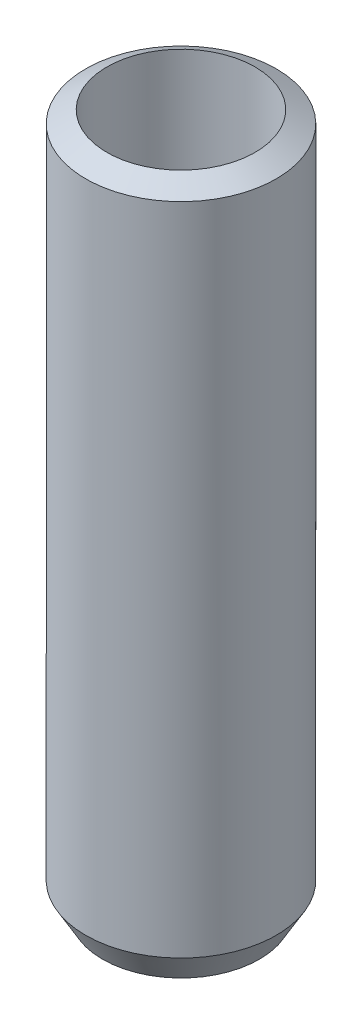
ISO-10303-21;
HEADER;
FILE_DESCRIPTION(('STEP AP214'),'2;1');
FILE_NAME('part.step','',(''),(''),'','','');
FILE_SCHEMA(('AUTOMOTIVE_DESIGN { 1 0 10303 214 1 1 1 1 }'));
ENDSEC;
DATA;
#1=APPLICATION_CONTEXT('core data for automotive mechanical design processes');
#2=APPLICATION_PROTOCOL_DEFINITION('international standard','automotive_design',2000,#1);
#3=PRODUCT_CONTEXT('',#1,'mechanical');
#4=PRODUCT('Part','Part','',(#3));
#5=PRODUCT_RELATED_PRODUCT_CATEGORY('part','',(#4));
#6=PRODUCT_DEFINITION_FORMATION('','',#4);
#7=PRODUCT_DEFINITION_CONTEXT('part definition',#1,'design');
#8=PRODUCT_DEFINITION('design','',#6,#7);
#9=PRODUCT_DEFINITION_SHAPE('','',#8);
#10=(LENGTH_UNIT() NAMED_UNIT(*) SI_UNIT(.MILLI.,.METRE.));
#11=(NAMED_UNIT(*) PLANE_ANGLE_UNIT() SI_UNIT($,.RADIAN.));
#12=(NAMED_UNIT(*) SI_UNIT($,.STERADIAN.) SOLID_ANGLE_UNIT());
#13=UNCERTAINTY_MEASURE_WITH_UNIT(LENGTH_MEASURE(1.E-05),#10,'distance_accuracy_value','');
#14=(GEOMETRIC_REPRESENTATION_CONTEXT(3) GLOBAL_UNCERTAINTY_ASSIGNED_CONTEXT((#13)) GLOBAL_UNIT_ASSIGNED_CONTEXT((#10,
#11,#12)) REPRESENTATION_CONTEXT('',''));
#15=CARTESIAN_POINT('',(0.,0.,0.));
#16=DIRECTION('',(0.,0.,1.));
#17=DIRECTION('',(1.,0.,0.));
#18=AXIS2_PLACEMENT_3D('',#15,#16,#17);
#19=CARTESIAN_POINT('',(0.,202.297191738934,0.));
#20=DIRECTION('',(0.,-1.,0.));
#21=DIRECTION('',(0.,0.,-1.));
#22=AXIS2_PLACEMENT_3D('',#19,#20,#21);
#23=CYLINDRICAL_SURFACE('',#22,27.5);
#24=CARTESIAN_POINT('',(0.,197.431912768181,0.));
#25=DIRECTION('',(0.,1.,0.));
#26=DIRECTION('',(0.,0.,1.));
#27=AXIS2_PLACEMENT_3D('',#24,#25,#26);
#28=CIRCLE('',#27,27.5);
#29=CARTESIAN_POINT('',(0.,197.431912768181,-27.5));
#30=VERTEX_POINT('',#29);
#31=EDGE_CURVE('E50',#30,#30,#28,.F.);
#32=CARTESIAN_POINT('',(0.,8.42691037034057,0.));
#33=DIRECTION('',(0.,1.,0.));
#34=DIRECTION('',(0.,0.,1.));
#35=AXIS2_PLACEMENT_3D('',#32,#33,#34);
#36=CIRCLE('',#35,27.5);
#37=CARTESIAN_POINT('',(0.,8.42691037034057,-27.5));
#38=VERTEX_POINT('',#37);
#39=EDGE_CURVE('E51',#38,#38,#36,.T.);
#40=CARTESIAN_POINT('',(0.,197.431912768181,-27.5));
#41=CARTESIAN_POINT('',(0.,195.46311065987,-27.5));
#42=CARTESIAN_POINT('',(0.,193.494308551559,-27.5));
#43=CARTESIAN_POINT('',(0.,189.556704334937,-27.5));
#44=CARTESIAN_POINT('',(0.,187.587902226627,-27.5));
#45=CARTESIAN_POINT('',(0.,183.650298010005,-27.5));
#46=CARTESIAN_POINT('',(0.,181.681495901694,-27.5));
#47=CARTESIAN_POINT('',(0.,177.743891685072,-27.5));
#48=CARTESIAN_POINT('',(0.,175.775089576762,-27.5));
#49=CARTESIAN_POINT('',(0.,171.83748536014,-27.5));
#50=CARTESIAN_POINT('',(0.,169.868683251829,-27.5));
#51=CARTESIAN_POINT('',(0.,165.931079035207,-27.5));
#52=CARTESIAN_POINT('',(0.,163.962276926897,-27.5));
#53=CARTESIAN_POINT('',(0.,160.024672710275,-27.5));
#54=CARTESIAN_POINT('',(0.,158.055870601964,-27.5));
#55=CARTESIAN_POINT('',(0.,154.118266385342,-27.5));
#56=CARTESIAN_POINT('',(0.,152.149464277032,-27.5));
#57=CARTESIAN_POINT('',(0.,148.21186006041,-27.5));
#58=CARTESIAN_POINT('',(0.,146.243057952099,-27.5));
#59=CARTESIAN_POINT('',(0.,142.305453735477,-27.5));
#60=CARTESIAN_POINT('',(0.,140.336651627167,-27.5));
#61=CARTESIAN_POINT('',(0.,136.399047410545,-27.5));
#62=CARTESIAN_POINT('',(0.,134.430245302234,-27.5));
#63=CARTESIAN_POINT('',(0.,130.492641085612,-27.5));
#64=CARTESIAN_POINT('',(0.,128.523838977302,-27.5));
#65=CARTESIAN_POINT('',(0.,124.58623476068,-27.5));
#66=CARTESIAN_POINT('',(0.,122.617432652369,-27.5));
#67=CARTESIAN_POINT('',(0.,118.679828435747,-27.5));
#68=CARTESIAN_POINT('',(0.,116.711026327437,-27.5));
#69=CARTESIAN_POINT('',(0.,112.773422110815,-27.5));
#70=CARTESIAN_POINT('',(0.,110.804620002504,-27.5));
#71=CARTESIAN_POINT('',(0.,106.867015785882,-27.5));
#72=CARTESIAN_POINT('',(0.,104.898213677572,-27.5));
#73=CARTESIAN_POINT('',(0.,100.96060946095,-27.5));
#74=CARTESIAN_POINT('',(0.,98.991807352639,-27.5));
#75=CARTESIAN_POINT('',(0.,95.0542031360173,-27.5));
#76=CARTESIAN_POINT('',(0.,93.0854010277065,-27.5));
#77=CARTESIAN_POINT('',(0.,89.1477968110848,-27.5));
#78=CARTESIAN_POINT('',(0.,87.178994702774,-27.5));
#79=CARTESIAN_POINT('',(0.,83.2413904861523,-27.5));
#80=CARTESIAN_POINT('',(0.,81.2725883778415,-27.5));
#81=CARTESIAN_POINT('',(0.,77.3349841612198,-27.5));
#82=CARTESIAN_POINT('',(0.,75.366182052909,-27.5));
#83=CARTESIAN_POINT('',(0.,71.4285778362873,-27.5));
#84=CARTESIAN_POINT('',(0.,69.4597757279765,-27.5));
#85=CARTESIAN_POINT('',(0.,65.5221715113548,-27.5));
#86=CARTESIAN_POINT('',(0.,63.553369403044,-27.5));
#87=CARTESIAN_POINT('',(0.,59.6157651864223,-27.5));
#88=CARTESIAN_POINT('',(0.,57.6469630781115,-27.5));
#89=CARTESIAN_POINT('',(0.,53.7093588614898,-27.5));
#90=CARTESIAN_POINT('',(0.,51.740556753179,-27.5));
#91=CARTESIAN_POINT('',(0.,47.8029525365573,-27.5));
#92=CARTESIAN_POINT('',(0.,45.8341504282465,-27.5));
#93=CARTESIAN_POINT('',(0.,41.8965462116248,-27.5));
#94=CARTESIAN_POINT('',(0.,39.927744103314,-27.5));
#95=CARTESIAN_POINT('',(0.,35.9901398866923,-27.5));
#96=CARTESIAN_POINT('',(0.,34.0213377783815,-27.5));
#97=CARTESIAN_POINT('',(0.,30.0837335617598,-27.5));
#98=CARTESIAN_POINT('',(0.,28.114931453449,-27.5));
#99=CARTESIAN_POINT('',(0.,24.1773272368273,-27.5));
#100=CARTESIAN_POINT('',(0.,22.2085251285164,-27.5));
#101=CARTESIAN_POINT('',(0.,18.2709209118947,-27.5));
#102=CARTESIAN_POINT('',(0.,16.3021188035839,-27.5));
#103=CARTESIAN_POINT('',(0.,12.3645145869622,-27.5));
#104=CARTESIAN_POINT('',(0.,10.3957124786514,-27.5));
#105=CARTESIAN_POINT('',(0.,8.42691037034057,-27.5));
#106=B_SPLINE_CURVE_WITH_KNOTS('',3,(#40,#41,#42,#43,#44,#45,#46,#47,#48,#49,#50,#51,#52,#53,
#54,#55,#56,#57,#58,#59,#60,#61,#62,#63,#64,#65,#66,#67,#68,#69,#70,#71,#72,#73,#74,#75,#76,#77,
#78,#79,#80,#81,#82,#83,#84,#85,#86,#87,#88,#89,#90,#91,#92,#93,#94,#95,#96,#97,#98,#99,#100,
#101,#102,#103,#104,#105),.UNSPECIFIED.,.F.,.F.,(4,2,2,2,2,2,2,2,2,2,2,2,2,2,2,2,2,2,2,2,2,2,2,
2,2,2,2,2,2,2,2,2,4),(0.,5.90640632493253,11.812812649865,17.7192189747975,23.62562529973,
29.5320316246625,35.438437949595,41.3448442745275,47.2512505994601,53.1576569243926,
59.0640632493251,64.9704695742576,70.8768758991901,76.7832822241226,82.6896885490551,
88.5960948739876,94.5025011989201,100.408907523853,106.315313848785,112.221720173718,
118.12812649865,124.034532823583,129.940939148515,135.847345473448,141.75375179838,
147.660158123313,153.566564448245,159.472970773178,165.37937709811,171.285783423043,
177.192189747975,183.098596072908,189.00500239784),.UNSPECIFIED.);
#107=EDGE_CURVE('BSEAM39',#30,#38,#106,.T.);
#108=ORIENTED_EDGE('',*,*,#31,.T.);
#109=ORIENTED_EDGE('',*,*,#39,.T.);
#110=ORIENTED_EDGE('',*,*,#107,.T.);
#111=ORIENTED_EDGE('',*,*,#107,.F.);
#112=EDGE_LOOP('',(#108,#110,#109,#111));
#113=FACE_BOUND('',#112,.T.);
#114=ADVANCED_FACE('F39',(#113),#23,.T.);
#115=CARTESIAN_POINT('',(0.,0.,0.));
#116=DIRECTION('',(0.,1.,0.));
#117=DIRECTION('',(0.,0.,1.));
#118=AXIS2_PLACEMENT_3D('',#115,#116,#117);
#119=PLANE('',#118);
#120=CARTESIAN_POINT('',(0.,0.,0.));
#121=DIRECTION('',(0.,1.,0.));
#122=DIRECTION('',(0.,0.,1.));
#123=AXIS2_PLACEMENT_3D('',#120,#121,#122);
#124=CIRCLE('',#123,22.634721029247);
#125=CARTESIAN_POINT('',(0.,0.,22.634721029247));
#126=VERTEX_POINT('',#125);
#127=EDGE_CURVE('E10',#126,#126,#124,.F.);
#128=ORIENTED_EDGE('',*,*,#127,.T.);
#129=EDGE_LOOP('',(#128));
#130=FACE_BOUND('',#129,.T.);
#131=CARTESIAN_POINT('',(0.,0.,0.));
#132=DIRECTION('',(0.,1.,0.));
#133=DIRECTION('',(0.,0.,1.));
#134=AXIS2_PLACEMENT_3D('',#131,#132,#133);
#135=CIRCLE('',#134,21.3774367296382);
#136=CARTESIAN_POINT('',(0.,0.,-21.3774367296382));
#137=VERTEX_POINT('',#136);
#138=EDGE_CURVE('E58',#137,#137,#135,.T.);
#139=ORIENTED_EDGE('',*,*,#138,.T.);
#140=EDGE_LOOP('',(#139));
#141=FACE_BOUND('',#140,.T.);
#142=ADVANCED_FACE('F62',(#130,#141),#119,.F.);
#143=CARTESIAN_POINT('',(0.,202.297191738934,0.));
#144=DIRECTION('',(0.,-1.,0.));
#145=DIRECTION('',(0.,0.,-1.));
#146=AXIS2_PLACEMENT_3D('',#143,#144,#145);
#147=CYLINDRICAL_SURFACE('',#146,21.3774367296382);
#148=CARTESIAN_POINT('',(0.,200.966776320455,0.));
#149=DIRECTION('',(0.,-1.,0.));
#150=DIRECTION('',(0.,0.,-1.));
#151=AXIS2_PLACEMENT_3D('',#148,#149,#150);
#152=CIRCLE('',#151,21.3774367296382);
#153=CARTESIAN_POINT('',(0.,200.966776320455,-21.3774367296382));
#154=VERTEX_POINT('',#153);
#155=EDGE_CURVE('E54',#154,#154,#152,.F.);
#156=CARTESIAN_POINT('',(0.,200.966776320455,-21.3774367296382));
#157=CARTESIAN_POINT('',(0.,198.87337240045,-21.3774367296382));
#158=CARTESIAN_POINT('',(0.,196.779968480445,-21.3774367296382));
#159=CARTESIAN_POINT('',(0.,192.593160640436,-21.3774367296382));
#160=CARTESIAN_POINT('',(0.,190.499756720431,-21.3774367296382));
#161=CARTESIAN_POINT('',(0.,186.312948880422,-21.3774367296382));
#162=CARTESIAN_POINT('',(0.,184.219544960417,-21.3774367296382));
#163=CARTESIAN_POINT('',(0.,180.032737120407,-21.3774367296382));
#164=CARTESIAN_POINT('',(0.,177.939333200403,-21.3774367296382));
#165=CARTESIAN_POINT('',(0.,173.752525360393,-21.3774367296382));
#166=CARTESIAN_POINT('',(0.,171.659121440388,-21.3774367296382));
#167=CARTESIAN_POINT('',(0.,167.472313600379,-21.3774367296382));
#168=CARTESIAN_POINT('',(0.,165.378909680374,-21.3774367296382));
#169=CARTESIAN_POINT('',(0.,161.192101840365,-21.3774367296382));
#170=CARTESIAN_POINT('',(0.,159.09869792036,-21.3774367296382));
#171=CARTESIAN_POINT('',(0.,154.91189008035,-21.3774367296382));
#172=CARTESIAN_POINT('',(0.,152.818486160346,-21.3774367296382));
#173=CARTESIAN_POINT('',(0.,148.631678320336,-21.3774367296382));
#174=CARTESIAN_POINT('',(0.,146.538274400332,-21.3774367296382));
#175=CARTESIAN_POINT('',(0.,142.351466560322,-21.3774367296382));
#176=CARTESIAN_POINT('',(0.,140.258062640317,-21.3774367296382));
#177=CARTESIAN_POINT('',(0.,136.071254800308,-21.3774367296382));
#178=CARTESIAN_POINT('',(0.,133.977850880303,-21.3774367296382));
#179=CARTESIAN_POINT('',(0.,129.791043040294,-21.3774367296382));
#180=CARTESIAN_POINT('',(0.,127.697639120289,-21.3774367296382));
#181=CARTESIAN_POINT('',(0.,123.510831280279,-21.3774367296382));
#182=CARTESIAN_POINT('',(0.,121.417427360275,-21.3774367296382));
#183=CARTESIAN_POINT('',(0.,117.230619520265,-21.3774367296382));
#184=CARTESIAN_POINT('',(0.,115.13721560026,-21.3774367296382));
#185=CARTESIAN_POINT('',(0.,110.950407760251,-21.3774367296382));
#186=CARTESIAN_POINT('',(0.,108.857003840246,-21.3774367296382));
#187=CARTESIAN_POINT('',(0.,104.670196000237,-21.3774367296382));
#188=CARTESIAN_POINT('',(0.,102.576792080232,-21.3774367296382));
#189=CARTESIAN_POINT('',(0.,98.3899842402226,-21.3774367296382));
#190=CARTESIAN_POINT('',(0.,96.2965803202178,-21.3774367296382));
#191=CARTESIAN_POINT('',(0.,92.1097724802084,-21.3774367296382));
#192=CARTESIAN_POINT('',(0.,90.0163685602036,-21.3774367296382));
#193=CARTESIAN_POINT('',(0.,85.8295607201942,-21.3774367296382));
#194=CARTESIAN_POINT('',(0.,83.7361568001894,-21.3774367296382));
#195=CARTESIAN_POINT('',(0.,79.54934896018,-21.3774367296382));
#196=CARTESIAN_POINT('',(0.,77.4559450401752,-21.3774367296382));
#197=CARTESIAN_POINT('',(0.,73.2691372001657,-21.3774367296382));
#198=CARTESIAN_POINT('',(0.,71.175733280161,-21.3774367296382));
#199=CARTESIAN_POINT('',(0.,66.9889254401515,-21.3774367296382));
#200=CARTESIAN_POINT('',(0.,64.8955215201468,-21.3774367296382));
#201=CARTESIAN_POINT('',(0.,60.7087136801373,-21.3774367296382));
#202=CARTESIAN_POINT('',(0.,58.6153097601326,-21.3774367296382));
#203=CARTESIAN_POINT('',(0.,54.4285019201231,-21.3774367296382));
#204=CARTESIAN_POINT('',(0.,52.3350980001184,-21.3774367296382));
#205=CARTESIAN_POINT('',(0.,48.1482901601089,-21.3774367296382));
#206=CARTESIAN_POINT('',(0.,46.0548862401042,-21.3774367296382));
#207=CARTESIAN_POINT('',(0.,41.8680784000947,-21.3774367296382));
#208=CARTESIAN_POINT('',(0.,39.77467448009,-21.3774367296382));
#209=CARTESIAN_POINT('',(0.,35.5878666400805,-21.3774367296382));
#210=CARTESIAN_POINT('',(0.,33.4944627200758,-21.3774367296382));
#211=CARTESIAN_POINT('',(0.,29.3076548800663,-21.3774367296382));
#212=CARTESIAN_POINT('',(0.,27.2142509600616,-21.3774367296382));
#213=CARTESIAN_POINT('',(0.,23.0274431200521,-21.3774367296382));
#214=CARTESIAN_POINT('',(0.,20.9340392000473,-21.3774367296382));
#215=CARTESIAN_POINT('',(0.,16.7472313600379,-21.3774367296382));
#216=CARTESIAN_POINT('',(0.,14.6538274400331,-21.3774367296382));
#217=CARTESIAN_POINT('',(0.,10.4670196000237,-21.3774367296382));
#218=CARTESIAN_POINT('',(0.,8.37361568001891,-21.3774367296382));
#219=CARTESIAN_POINT('',(0.,4.18680784000944,-21.3774367296382));
#220=CARTESIAN_POINT('',(0.,2.0934039200047,-21.3774367296382));
#221=CARTESIAN_POINT('',(0.,0.,-21.3774367296382));
#222=B_SPLINE_CURVE_WITH_KNOTS('',3,(#156,#157,#158,#159,#160,#161,#162,#163,#164,#165,#166,
#167,#168,#169,#170,#171,#172,#173,#174,#175,#176,#177,#178,#179,#180,#181,#182,#183,#184,#185,
#186,#187,#188,#189,#190,#191,#192,#193,#194,#195,#196,#197,#198,#199,#200,#201,#202,#203,#204,
#205,#206,#207,#208,#209,#210,#211,#212,#213,#214,#215,#216,#217,#218,#219,#220,#221),
.UNSPECIFIED.,.F.,.F.,(4,2,2,2,2,2,2,2,2,2,2,2,2,2,2,2,2,2,2,2,2,2,2,2,2,2,2,2,2,2,2,2,4),(0.,
6.2802117600142,12.5604235200284,18.8406352800426,25.1208470400568,31.401058800071,
37.6812705600852,43.9614823200994,50.2416940801137,56.5219058401279,62.8021176001421,
69.0823293601563,75.3625411201705,81.6427528801847,87.9229646401989,94.2031764002131,
100.483388160227,106.763599920242,113.043811680256,119.32402344027,125.604235200284,
131.884446960298,138.164658720313,144.444870480327,150.725082240341,157.005294000355,
163.285505760369,169.565717520384,175.845929280398,182.126141040412,188.406352800426,
194.68656456044,200.966776320455),.UNSPECIFIED.);
#223=EDGE_CURVE('BSEAM68',#154,#137,#222,.T.);
#224=ORIENTED_EDGE('',*,*,#155,.T.);
#225=ORIENTED_EDGE('',*,*,#138,.F.);
#226=ORIENTED_EDGE('',*,*,#223,.T.);
#227=ORIENTED_EDGE('',*,*,#223,.F.);
#228=EDGE_LOOP('',(#224,#226,#225,#227));
#229=FACE_BOUND('',#228,.T.);
#230=ADVANCED_FACE('F68',(#229),#147,.F.);
#231=CARTESIAN_POINT('',(0.,202.297191738934,0.));
#232=DIRECTION('',(0.,-1.,0.));
#233=DIRECTION('',(0.,0.,-1.));
#234=AXIS2_PLACEMENT_3D('',#231,#232,#233);
#235=CONICAL_SURFACE('',#234,19.0730896296596,1.0471975511966);
#236=ORIENTED_EDGE('',*,*,#31,.F.);
#237=EDGE_LOOP('',(#236));
#238=FACE_BOUND('',#237,.T.);
#239=ORIENTED_EDGE('',*,*,#155,.F.);
#240=EDGE_LOOP('',(#239));
#241=FACE_BOUND('',#240,.T.);
#242=ADVANCED_FACE('F66',(#238,#241),#235,.T.);
#243=CARTESIAN_POINT('',(0.,8.42691037034057,0.));
#244=DIRECTION('',(0.,1.,0.));
#245=DIRECTION('',(0.,0.,1.));
#246=AXIS2_PLACEMENT_3D('',#243,#244,#245);
#247=CONICAL_SURFACE('',#246,27.5,0.523598775598301);
#248=ORIENTED_EDGE('',*,*,#127,.F.);
#249=EDGE_LOOP('',(#248));
#250=FACE_BOUND('',#249,.T.);
#251=ORIENTED_EDGE('',*,*,#39,.F.);
#252=EDGE_LOOP('',(#251));
#253=FACE_BOUND('',#252,.T.);
#254=ADVANCED_FACE('F45',(#250,#253),#247,.T.);
#255=CLOSED_SHELL('',(#114,#142,#230,#242,#254));
#256=MANIFOLD_SOLID_BREP('B2',#255);
#257=ADVANCED_BREP_SHAPE_REPRESENTATION('',(#18,#256),#14);
#258=SHAPE_DEFINITION_REPRESENTATION(#9,#257);
ENDSEC;
END-ISO-10303-21;
